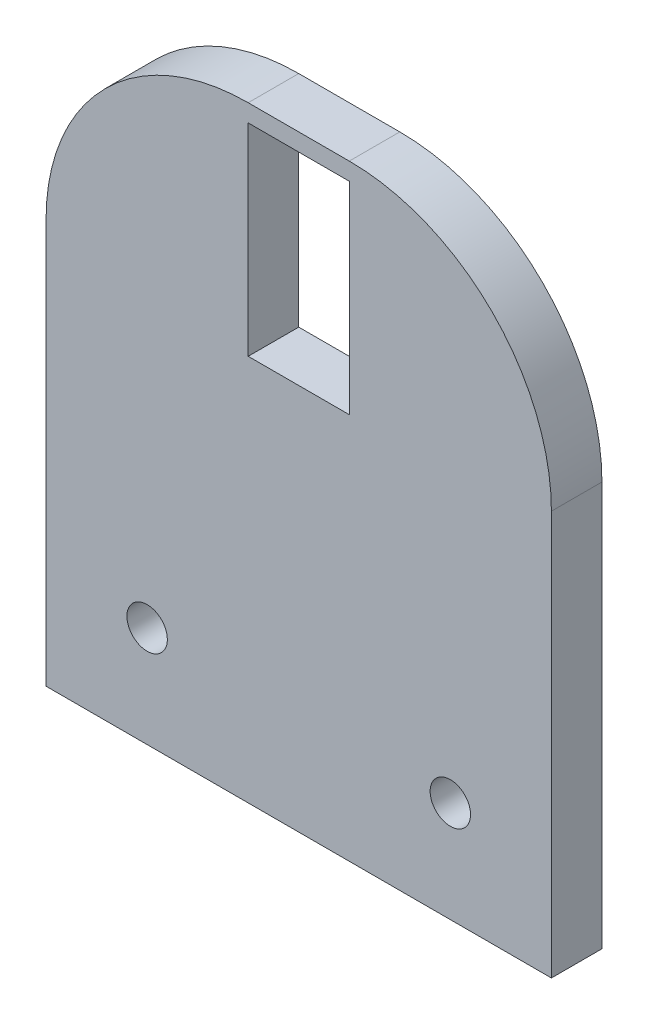
ISO-10303-21;
HEADER;
FILE_DESCRIPTION(('STEP AP214'),'2;1');
FILE_NAME('part.step','',(''),(''),'','','');
FILE_SCHEMA(('AUTOMOTIVE_DESIGN { 1 0 10303 214 1 1 1 1 }'));
ENDSEC;
DATA;
#1=APPLICATION_CONTEXT('core data for automotive mechanical design processes');
#2=APPLICATION_PROTOCOL_DEFINITION('international standard','automotive_design',2000,#1);
#3=PRODUCT_CONTEXT('',#1,'mechanical');
#4=PRODUCT('Part','Part','',(#3));
#5=PRODUCT_RELATED_PRODUCT_CATEGORY('part','',(#4));
#6=PRODUCT_DEFINITION_FORMATION('','',#4);
#7=PRODUCT_DEFINITION_CONTEXT('part definition',#1,'design');
#8=PRODUCT_DEFINITION('design','',#6,#7);
#9=PRODUCT_DEFINITION_SHAPE('','',#8);
#10=(LENGTH_UNIT() NAMED_UNIT(*) SI_UNIT(.MILLI.,.METRE.));
#11=(NAMED_UNIT(*) PLANE_ANGLE_UNIT() SI_UNIT($,.RADIAN.));
#12=(NAMED_UNIT(*) SI_UNIT($,.STERADIAN.) SOLID_ANGLE_UNIT());
#13=UNCERTAINTY_MEASURE_WITH_UNIT(LENGTH_MEASURE(1.E-05),#10,'distance_accuracy_value','');
#14=(GEOMETRIC_REPRESENTATION_CONTEXT(3) GLOBAL_UNCERTAINTY_ASSIGNED_CONTEXT((#13)) GLOBAL_UNIT_ASSIGNED_CONTEXT((#10,
#11,#12)) REPRESENTATION_CONTEXT('',''));
#15=CARTESIAN_POINT('',(0.,0.,0.));
#16=DIRECTION('',(0.,0.,1.));
#17=DIRECTION('',(1.,0.,0.));
#18=AXIS2_PLACEMENT_3D('',#15,#16,#17);
#19=CARTESIAN_POINT('',(-25.,60.,-2.5));
#20=DIRECTION('',(1.,0.,0.));
#21=DIRECTION('',(0.,0.,-1.));
#22=AXIS2_PLACEMENT_3D('',#19,#20,#21);
#23=PLANE('',#22);
#24=DIRECTION('',(0.,-1.,0.));
#25=VECTOR('',#24,1.);
#26=CARTESIAN_POINT('',(-25.,60.,2.5));
#27=LINE('',#26,#25);
#28=CARTESIAN_POINT('',(-25.,40.,2.5));
#29=VERTEX_POINT('',#28);
#30=CARTESIAN_POINT('',(-25.,0.,2.5));
#31=VERTEX_POINT('',#30);
#32=EDGE_CURVE('E181',#29,#31,#27,.T.);
#33=ORIENTED_EDGE('',*,*,#32,.F.);
#34=DIRECTION('',(0.,0.,1.));
#35=VECTOR('',#34,1.);
#36=CARTESIAN_POINT('',(-25.,40.,-2.5));
#37=LINE('',#36,#35);
#38=CARTESIAN_POINT('',(-25.,40.,-2.5));
#39=VERTEX_POINT('',#38);
#40=EDGE_CURVE('E193',#29,#39,#37,.F.);
#41=ORIENTED_EDGE('',*,*,#40,.T.);
#42=DIRECTION('',(0.,-1.,0.));
#43=VECTOR('',#42,1.);
#44=CARTESIAN_POINT('',(-25.,60.,-2.5));
#45=LINE('',#44,#43);
#46=CARTESIAN_POINT('',(-25.,0.,-2.5));
#47=VERTEX_POINT('',#46);
#48=EDGE_CURVE('E165',#39,#47,#45,.T.);
#49=ORIENTED_EDGE('',*,*,#48,.T.);
#50=DIRECTION('',(0.,0.,1.));
#51=VECTOR('',#50,1.);
#52=CARTESIAN_POINT('',(-25.,0.,-2.5));
#53=LINE('',#52,#51);
#54=EDGE_CURVE('E155',#47,#31,#53,.T.);
#55=ORIENTED_EDGE('',*,*,#54,.T.);
#56=EDGE_LOOP('',(#33,#41,#49,#55));
#57=FACE_BOUND('',#56,.T.);
#58=ADVANCED_FACE('F33',(#57),#23,.F.);
#59=CARTESIAN_POINT('',(25.,60.,2.5));
#60=DIRECTION('',(0.,0.,-1.));
#61=DIRECTION('',(-1.,0.,0.));
#62=AXIS2_PLACEMENT_3D('',#59,#60,#61);
#63=PLANE('',#62);
#64=DIRECTION('',(-1.,0.,0.));
#65=VECTOR('',#64,1.);
#66=CARTESIAN_POINT('',(-5.00000000000001,58.2714140175471,2.5));
#67=LINE('',#66,#65);
#68=CARTESIAN_POINT('',(4.99999999999998,58.2714140175471,2.5));
#69=VERTEX_POINT('',#68);
#70=CARTESIAN_POINT('',(-5.00000000000001,58.2714140175471,2.5));
#71=VERTEX_POINT('',#70);
#72=EDGE_CURVE('E136',#69,#71,#67,.T.);
#73=ORIENTED_EDGE('',*,*,#72,.F.);
#74=DIRECTION('',(0.,1.,0.));
#75=VECTOR('',#74,1.);
#76=CARTESIAN_POINT('',(4.99999999999999,58.2714140175471,2.5));
#77=LINE('',#76,#75);
#78=CARTESIAN_POINT('',(4.99999999999999,38.2714140175471,2.5));
#79=VERTEX_POINT('',#78);
#80=EDGE_CURVE('E48',#79,#69,#77,.T.);
#81=ORIENTED_EDGE('',*,*,#80,.F.);
#82=DIRECTION('',(1.,0.,0.));
#83=VECTOR('',#82,1.);
#84=CARTESIAN_POINT('',(-5.00000000000001,38.2714140175471,2.5));
#85=LINE('',#84,#83);
#86=CARTESIAN_POINT('',(-5.00000000000001,38.2714140175471,2.5));
#87=VERTEX_POINT('',#86);
#88=EDGE_CURVE('E127',#87,#79,#85,.T.);
#89=ORIENTED_EDGE('',*,*,#88,.F.);
#90=DIRECTION('',(0.,-1.,0.));
#91=VECTOR('',#90,1.);
#92=CARTESIAN_POINT('',(-5.00000000000001,58.2714140175471,2.5));
#93=LINE('',#92,#91);
#94=EDGE_CURVE('E130',#71,#87,#93,.T.);
#95=ORIENTED_EDGE('',*,*,#94,.F.);
#96=EDGE_LOOP('',(#73,#81,#89,#95));
#97=FACE_BOUND('',#96,.T.);
#98=CARTESIAN_POINT('',(15.,10.,2.5));
#99=DIRECTION('',(0.,0.,1.));
#100=DIRECTION('',(1.,0.,0.));
#101=AXIS2_PLACEMENT_3D('',#98,#99,#100);
#102=CIRCLE('',#101,2.);
#103=CARTESIAN_POINT('',(17.,10.,2.5));
#104=VERTEX_POINT('',#103);
#105=EDGE_CURVE('E142',#104,#104,#102,.T.);
#106=ORIENTED_EDGE('',*,*,#105,.F.);
#107=EDGE_LOOP('',(#106));
#108=FACE_BOUND('',#107,.T.);
#109=CARTESIAN_POINT('',(-15.,10.,2.5));
#110=DIRECTION('',(0.,0.,1.));
#111=DIRECTION('',(1.,0.,0.));
#112=AXIS2_PLACEMENT_3D('',#109,#110,#111);
#113=CIRCLE('',#112,2.);
#114=CARTESIAN_POINT('',(-13.,10.,2.5));
#115=VERTEX_POINT('',#114);
#116=EDGE_CURVE('E149',#115,#115,#113,.T.);
#117=ORIENTED_EDGE('',*,*,#116,.F.);
#118=EDGE_LOOP('',(#117));
#119=FACE_BOUND('',#118,.T.);
#120=DIRECTION('',(1.,0.,0.));
#121=VECTOR('',#120,1.);
#122=CARTESIAN_POINT('',(25.,60.,2.5));
#123=LINE('',#122,#121);
#124=CARTESIAN_POINT('',(-5.,60.,2.5));
#125=VERTEX_POINT('',#124);
#126=CARTESIAN_POINT('',(5.00000000000001,60.,2.5));
#127=VERTEX_POINT('',#126);
#128=EDGE_CURVE('E158',#125,#127,#123,.T.);
#129=ORIENTED_EDGE('',*,*,#128,.F.);
#130=CARTESIAN_POINT('',(-5.,40.,2.5));
#131=DIRECTION('',(0.,0.,-1.));
#132=DIRECTION('',(-1.,0.,0.));
#133=AXIS2_PLACEMENT_3D('',#130,#131,#132);
#134=CIRCLE('',#133,20.);
#135=EDGE_CURVE('E191',#125,#29,#134,.F.);
#136=ORIENTED_EDGE('',*,*,#135,.T.);
#137=ORIENTED_EDGE('',*,*,#32,.T.);
#138=DIRECTION('',(1.,0.,0.));
#139=VECTOR('',#138,1.);
#140=CARTESIAN_POINT('',(25.,0.,2.5));
#141=LINE('',#140,#139);
#142=CARTESIAN_POINT('',(25.,0.,2.5));
#143=VERTEX_POINT('',#142);
#144=EDGE_CURVE('E168',#31,#143,#141,.T.);
#145=ORIENTED_EDGE('',*,*,#144,.T.);
#146=DIRECTION('',(0.,-1.,0.));
#147=VECTOR('',#146,1.);
#148=CARTESIAN_POINT('',(25.,60.,2.5));
#149=LINE('',#148,#147);
#150=CARTESIAN_POINT('',(25.,40.,2.5));
#151=VERTEX_POINT('',#150);
#152=EDGE_CURVE('E179',#151,#143,#149,.T.);
#153=ORIENTED_EDGE('',*,*,#152,.F.);
#154=CARTESIAN_POINT('',(5.00000000000001,40.,2.5));
#155=DIRECTION('',(0.,0.,-1.));
#156=DIRECTION('',(-1.,0.,0.));
#157=AXIS2_PLACEMENT_3D('',#154,#155,#156);
#158=CIRCLE('',#157,20.);
#159=EDGE_CURVE('E189',#151,#127,#158,.F.);
#160=ORIENTED_EDGE('',*,*,#159,.T.);
#161=EDGE_LOOP('',(#129,#136,#137,#145,#153,#160));
#162=FACE_BOUND('',#161,.T.);
#163=ADVANCED_FACE('F210',(#97,#108,#119,#162),#63,.F.);
#164=CARTESIAN_POINT('',(25.,60.,-2.5));
#165=DIRECTION('',(-1.,0.,0.));
#166=DIRECTION('',(0.,0.,1.));
#167=AXIS2_PLACEMENT_3D('',#164,#165,#166);
#168=PLANE('',#167);
#169=DIRECTION('',(0.,-1.,0.));
#170=VECTOR('',#169,1.);
#171=CARTESIAN_POINT('',(25.,60.,-2.5));
#172=LINE('',#171,#170);
#173=CARTESIAN_POINT('',(25.,40.,-2.5));
#174=VERTEX_POINT('',#173);
#175=CARTESIAN_POINT('',(25.,0.,-2.5));
#176=VERTEX_POINT('',#175);
#177=EDGE_CURVE('E177',#174,#176,#172,.T.);
#178=ORIENTED_EDGE('',*,*,#177,.F.);
#179=DIRECTION('',(0.,0.,-1.));
#180=VECTOR('',#179,1.);
#181=CARTESIAN_POINT('',(25.,40.,-2.5));
#182=LINE('',#181,#180);
#183=EDGE_CURVE('E11',#174,#151,#182,.F.);
#184=ORIENTED_EDGE('',*,*,#183,.T.);
#185=ORIENTED_EDGE('',*,*,#152,.T.);
#186=DIRECTION('',(0.,0.,-1.));
#187=VECTOR('',#186,1.);
#188=CARTESIAN_POINT('',(25.,0.,-2.5));
#189=LINE('',#188,#187);
#190=EDGE_CURVE('E171',#143,#176,#189,.T.);
#191=ORIENTED_EDGE('',*,*,#190,.T.);
#192=EDGE_LOOP('',(#178,#184,#185,#191));
#193=FACE_BOUND('',#192,.T.);
#194=ADVANCED_FACE('F224',(#193),#168,.F.);
#195=CARTESIAN_POINT('',(25.,60.,-2.5));
#196=DIRECTION('',(0.,0.,1.));
#197=DIRECTION('',(1.,0.,0.));
#198=AXIS2_PLACEMENT_3D('',#195,#196,#197);
#199=PLANE('',#198);
#200=DIRECTION('',(1.,0.,0.));
#201=VECTOR('',#200,1.);
#202=CARTESIAN_POINT('',(-5.00000000000001,38.2714140175471,-2.5));
#203=LINE('',#202,#201);
#204=CARTESIAN_POINT('',(-5.00000000000001,38.2714140175471,-2.5));
#205=VERTEX_POINT('',#204);
#206=CARTESIAN_POINT('',(4.99999999999999,38.2714140175471,-2.5));
#207=VERTEX_POINT('',#206);
#208=EDGE_CURVE('E117',#205,#207,#203,.T.);
#209=ORIENTED_EDGE('',*,*,#208,.T.);
#210=DIRECTION('',(0.,1.,0.));
#211=VECTOR('',#210,1.);
#212=CARTESIAN_POINT('',(4.99999999999999,58.2714140175471,-2.5));
#213=LINE('',#212,#211);
#214=CARTESIAN_POINT('',(4.99999999999999,58.2714140175471,-2.5));
#215=VERTEX_POINT('',#214);
#216=EDGE_CURVE('E111',#207,#215,#213,.T.);
#217=ORIENTED_EDGE('',*,*,#216,.T.);
#218=DIRECTION('',(-1.,0.,0.));
#219=VECTOR('',#218,1.);
#220=CARTESIAN_POINT('',(-5.00000000000001,58.2714140175471,-2.5));
#221=LINE('',#220,#219);
#222=CARTESIAN_POINT('',(-5.00000000000001,58.2714140175471,-2.5));
#223=VERTEX_POINT('',#222);
#224=EDGE_CURVE('E120',#215,#223,#221,.T.);
#225=ORIENTED_EDGE('',*,*,#224,.T.);
#226=DIRECTION('',(0.,-1.,0.));
#227=VECTOR('',#226,1.);
#228=CARTESIAN_POINT('',(-5.00000000000001,58.2714140175471,-2.5));
#229=LINE('',#228,#227);
#230=EDGE_CURVE('E56',#223,#205,#229,.T.);
#231=ORIENTED_EDGE('',*,*,#230,.T.);
#232=EDGE_LOOP('',(#209,#217,#225,#231));
#233=FACE_BOUND('',#232,.T.);
#234=CARTESIAN_POINT('',(15.,10.,-2.5));
#235=DIRECTION('',(0.,0.,1.));
#236=DIRECTION('',(1.,0.,0.));
#237=AXIS2_PLACEMENT_3D('',#234,#235,#236);
#238=CIRCLE('',#237,2.);
#239=CARTESIAN_POINT('',(17.,10.,-2.5));
#240=VERTEX_POINT('',#239);
#241=EDGE_CURVE('E146',#240,#240,#238,.T.);
#242=ORIENTED_EDGE('',*,*,#241,.T.);
#243=EDGE_LOOP('',(#242));
#244=FACE_BOUND('',#243,.T.);
#245=CARTESIAN_POINT('',(-15.,10.,-2.5));
#246=DIRECTION('',(0.,0.,1.));
#247=DIRECTION('',(1.,0.,0.));
#248=AXIS2_PLACEMENT_3D('',#245,#246,#247);
#249=CIRCLE('',#248,2.);
#250=CARTESIAN_POINT('',(-13.,10.,-2.5));
#251=VERTEX_POINT('',#250);
#252=EDGE_CURVE('E152',#251,#251,#249,.T.);
#253=ORIENTED_EDGE('',*,*,#252,.T.);
#254=EDGE_LOOP('',(#253));
#255=FACE_BOUND('',#254,.T.);
#256=ORIENTED_EDGE('',*,*,#48,.F.);
#257=CARTESIAN_POINT('',(-5.,40.,-2.5));
#258=DIRECTION('',(0.,0.,1.));
#259=DIRECTION('',(1.,0.,0.));
#260=AXIS2_PLACEMENT_3D('',#257,#258,#259);
#261=CIRCLE('',#260,20.);
#262=CARTESIAN_POINT('',(-5.,60.,-2.5));
#263=VERTEX_POINT('',#262);
#264=EDGE_CURVE('E41',#39,#263,#261,.F.);
#265=ORIENTED_EDGE('',*,*,#264,.T.);
#266=DIRECTION('',(-1.,0.,0.));
#267=VECTOR('',#266,1.);
#268=CARTESIAN_POINT('',(25.,60.,-2.5));
#269=LINE('',#268,#267);
#270=CARTESIAN_POINT('',(5.00000000000001,60.,-2.5));
#271=VERTEX_POINT('',#270);
#272=EDGE_CURVE('E161',#271,#263,#269,.T.);
#273=ORIENTED_EDGE('',*,*,#272,.F.);
#274=CARTESIAN_POINT('',(5.00000000000001,40.,-2.5));
#275=DIRECTION('',(0.,0.,1.));
#276=DIRECTION('',(1.,0.,0.));
#277=AXIS2_PLACEMENT_3D('',#274,#275,#276);
#278=CIRCLE('',#277,20.);
#279=EDGE_CURVE('E195',#271,#174,#278,.F.);
#280=ORIENTED_EDGE('',*,*,#279,.T.);
#281=ORIENTED_EDGE('',*,*,#177,.T.);
#282=DIRECTION('',(-1.,0.,0.));
#283=VECTOR('',#282,1.);
#284=CARTESIAN_POINT('',(25.,0.,-2.5));
#285=LINE('',#284,#283);
#286=EDGE_CURVE('E162',#176,#47,#285,.T.);
#287=ORIENTED_EDGE('',*,*,#286,.T.);
#288=EDGE_LOOP('',(#256,#265,#273,#280,#281,#287));
#289=FACE_BOUND('',#288,.T.);
#290=ADVANCED_FACE('F124',(#233,#244,#255,#289),#199,.F.);
#291=CARTESIAN_POINT('',(0.,60.,0.));
#292=DIRECTION('',(0.,-1.,0.));
#293=DIRECTION('',(0.,0.,-1.));
#294=AXIS2_PLACEMENT_3D('',#291,#292,#293);
#295=PLANE('',#294);
#296=ORIENTED_EDGE('',*,*,#272,.T.);
#297=DIRECTION('',(0.,0.,1.));
#298=VECTOR('',#297,1.);
#299=CARTESIAN_POINT('',(-5.,60.,0.));
#300=LINE('',#299,#298);
#301=EDGE_CURVE('E186',#263,#125,#300,.T.);
#302=ORIENTED_EDGE('',*,*,#301,.T.);
#303=ORIENTED_EDGE('',*,*,#128,.T.);
#304=DIRECTION('',(0.,0.,-1.));
#305=VECTOR('',#304,1.);
#306=CARTESIAN_POINT('',(5.00000000000001,60.,0.));
#307=LINE('',#306,#305);
#308=EDGE_CURVE('E183',#127,#271,#307,.T.);
#309=ORIENTED_EDGE('',*,*,#308,.T.);
#310=EDGE_LOOP('',(#296,#302,#303,#309));
#311=FACE_BOUND('',#310,.T.);
#312=ADVANCED_FACE('F204',(#311),#295,.F.);
#313=CARTESIAN_POINT('',(0.,0.,0.));
#314=DIRECTION('',(0.,-1.,0.));
#315=DIRECTION('',(0.,0.,-1.));
#316=AXIS2_PLACEMENT_3D('',#313,#314,#315);
#317=PLANE('',#316);
#318=ORIENTED_EDGE('',*,*,#54,.F.);
#319=ORIENTED_EDGE('',*,*,#286,.F.);
#320=ORIENTED_EDGE('',*,*,#190,.F.);
#321=ORIENTED_EDGE('',*,*,#144,.F.);
#322=EDGE_LOOP('',(#318,#319,#320,#321));
#323=FACE_BOUND('',#322,.T.);
#324=ADVANCED_FACE('F216',(#323),#317,.T.);
#325=CARTESIAN_POINT('',(-5.,40.,0.));
#326=DIRECTION('',(0.,0.,1.));
#327=DIRECTION('',(1.,0.,0.));
#328=AXIS2_PLACEMENT_3D('',#325,#326,#327);
#329=CYLINDRICAL_SURFACE('',#328,20.);
#330=ORIENTED_EDGE('',*,*,#264,.F.);
#331=ORIENTED_EDGE('',*,*,#40,.F.);
#332=ORIENTED_EDGE('',*,*,#135,.F.);
#333=ORIENTED_EDGE('',*,*,#301,.F.);
#334=EDGE_LOOP('',(#330,#331,#332,#333));
#335=FACE_BOUND('',#334,.T.);
#336=ADVANCED_FACE('F207',(#335),#329,.T.);
#337=CARTESIAN_POINT('',(5.00000000000001,40.,0.));
#338=DIRECTION('',(0.,0.,-1.));
#339=DIRECTION('',(-1.,0.,0.));
#340=AXIS2_PLACEMENT_3D('',#337,#338,#339);
#341=CYLINDRICAL_SURFACE('',#340,20.);
#342=ORIENTED_EDGE('',*,*,#159,.F.);
#343=ORIENTED_EDGE('',*,*,#183,.F.);
#344=ORIENTED_EDGE('',*,*,#279,.F.);
#345=ORIENTED_EDGE('',*,*,#308,.F.);
#346=EDGE_LOOP('',(#342,#343,#344,#345));
#347=FACE_BOUND('',#346,.T.);
#348=ADVANCED_FACE('F35',(#347),#341,.T.);
#349=CARTESIAN_POINT('',(-15.,10.,-2.5));
#350=DIRECTION('',(0.,0.,1.));
#351=DIRECTION('',(1.,0.,0.));
#352=AXIS2_PLACEMENT_3D('',#349,#350,#351);
#353=CYLINDRICAL_SURFACE('',#352,2.);
#354=ORIENTED_EDGE('',*,*,#252,.F.);
#355=EDGE_LOOP('',(#354));
#356=FACE_BOUND('',#355,.T.);
#357=ORIENTED_EDGE('',*,*,#116,.T.);
#358=EDGE_LOOP('',(#357));
#359=FACE_BOUND('',#358,.T.);
#360=ADVANCED_FACE('F245',(#356,#359),#353,.F.);
#361=CARTESIAN_POINT('',(15.,10.,-2.5));
#362=DIRECTION('',(0.,0.,1.));
#363=DIRECTION('',(1.,0.,0.));
#364=AXIS2_PLACEMENT_3D('',#361,#362,#363);
#365=CYLINDRICAL_SURFACE('',#364,2.);
#366=ORIENTED_EDGE('',*,*,#241,.F.);
#367=EDGE_LOOP('',(#366));
#368=FACE_BOUND('',#367,.T.);
#369=ORIENTED_EDGE('',*,*,#105,.T.);
#370=EDGE_LOOP('',(#369));
#371=FACE_BOUND('',#370,.T.);
#372=ADVANCED_FACE('F254',(#368,#371),#365,.F.);
#373=CARTESIAN_POINT('',(4.99999999999999,58.2714140175471,-2.5));
#374=DIRECTION('',(1.,0.,0.));
#375=DIRECTION('',(0.,1.,0.));
#376=AXIS2_PLACEMENT_3D('',#373,#374,#375);
#377=PLANE('',#376);
#378=ORIENTED_EDGE('',*,*,#80,.T.);
#379=DIRECTION('',(0.,0.,1.));
#380=VECTOR('',#379,1.);
#381=CARTESIAN_POINT('',(4.99999999999999,58.2714140175471,-2.5));
#382=LINE('',#381,#380);
#383=EDGE_CURVE('E107',#215,#69,#382,.T.);
#384=ORIENTED_EDGE('',*,*,#383,.F.);
#385=ORIENTED_EDGE('',*,*,#216,.F.);
#386=DIRECTION('',(0.,0.,1.));
#387=VECTOR('',#386,1.);
#388=CARTESIAN_POINT('',(4.99999999999999,38.2714140175471,-2.5));
#389=LINE('',#388,#387);
#390=EDGE_CURVE('E140',#207,#79,#389,.T.);
#391=ORIENTED_EDGE('',*,*,#390,.T.);
#392=EDGE_LOOP('',(#378,#384,#385,#391));
#393=FACE_BOUND('',#392,.T.);
#394=ADVANCED_FACE('F109',(#393),#377,.F.);
#395=CARTESIAN_POINT('',(-5.00000000000001,38.2714140175471,-2.5));
#396=DIRECTION('',(0.,-1.,0.));
#397=DIRECTION('',(0.,0.,-1.));
#398=AXIS2_PLACEMENT_3D('',#395,#396,#397);
#399=PLANE('',#398);
#400=ORIENTED_EDGE('',*,*,#88,.T.);
#401=ORIENTED_EDGE('',*,*,#390,.F.);
#402=ORIENTED_EDGE('',*,*,#208,.F.);
#403=DIRECTION('',(0.,0.,1.));
#404=VECTOR('',#403,1.);
#405=CARTESIAN_POINT('',(-5.00000000000001,38.2714140175471,-2.5));
#406=LINE('',#405,#404);
#407=EDGE_CURVE('E143',#205,#87,#406,.T.);
#408=ORIENTED_EDGE('',*,*,#407,.T.);
#409=EDGE_LOOP('',(#400,#401,#402,#408));
#410=FACE_BOUND('',#409,.T.);
#411=ADVANCED_FACE('F261',(#410),#399,.F.);
#412=CARTESIAN_POINT('',(-5.00000000000001,58.2714140175471,-2.5));
#413=DIRECTION('',(-1.,0.,0.));
#414=DIRECTION('',(0.,-1.,0.));
#415=AXIS2_PLACEMENT_3D('',#412,#413,#414);
#416=PLANE('',#415);
#417=ORIENTED_EDGE('',*,*,#94,.T.);
#418=ORIENTED_EDGE('',*,*,#407,.F.);
#419=ORIENTED_EDGE('',*,*,#230,.F.);
#420=DIRECTION('',(0.,0.,1.));
#421=VECTOR('',#420,1.);
#422=CARTESIAN_POINT('',(-5.00000000000001,58.2714140175471,-2.5));
#423=LINE('',#422,#421);
#424=EDGE_CURVE('E116',#223,#71,#423,.T.);
#425=ORIENTED_EDGE('',*,*,#424,.T.);
#426=EDGE_LOOP('',(#417,#418,#419,#425));
#427=FACE_BOUND('',#426,.T.);
#428=ADVANCED_FACE('F264',(#427),#416,.F.);
#429=CARTESIAN_POINT('',(-5.00000000000001,58.2714140175471,-2.5));
#430=DIRECTION('',(0.,1.,0.));
#431=DIRECTION('',(0.,0.,1.));
#432=AXIS2_PLACEMENT_3D('',#429,#430,#431);
#433=PLANE('',#432);
#434=ORIENTED_EDGE('',*,*,#72,.T.);
#435=ORIENTED_EDGE('',*,*,#424,.F.);
#436=ORIENTED_EDGE('',*,*,#224,.F.);
#437=ORIENTED_EDGE('',*,*,#383,.T.);
#438=EDGE_LOOP('',(#434,#435,#436,#437));
#439=FACE_BOUND('',#438,.T.);
#440=ADVANCED_FACE('F121',(#439),#433,.F.);
#441=CLOSED_SHELL('',(#58,#163,#194,#290,#312,#324,#336,#348,#360,#372,#394,#411,#428,#440));
#442=MANIFOLD_SOLID_BREP('B2',#441);
#443=ADVANCED_BREP_SHAPE_REPRESENTATION('',(#18,#442),#14);
#444=SHAPE_DEFINITION_REPRESENTATION(#9,#443);
ENDSEC;
END-ISO-10303-21;
